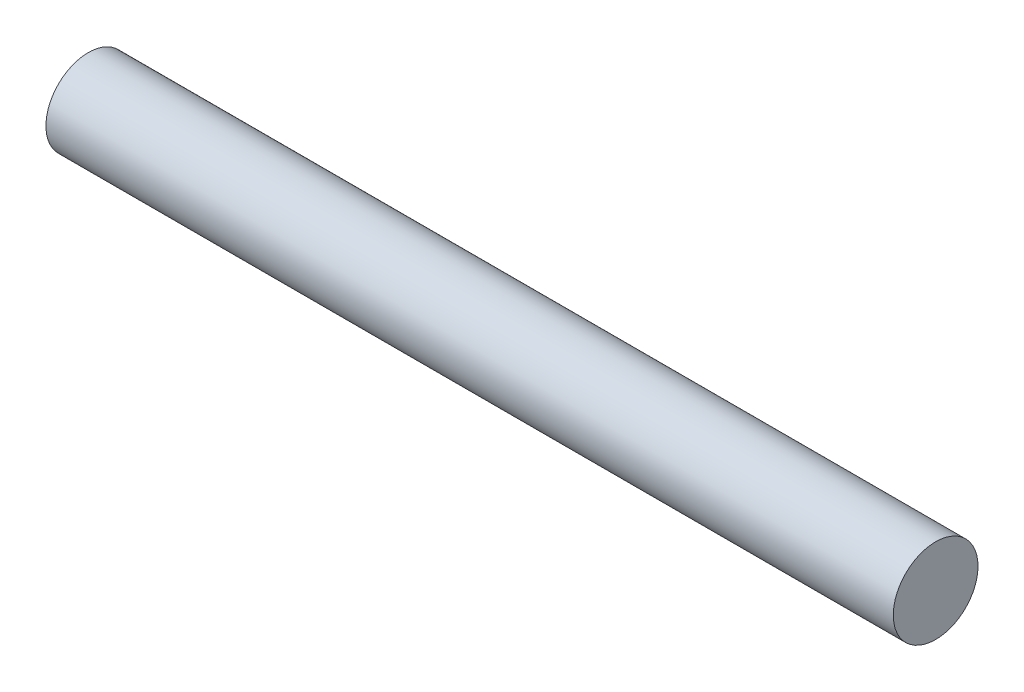
ISO-10303-21;
HEADER;
FILE_DESCRIPTION(('STEP AP214'),'2;1');
FILE_NAME('part.step','',(''),(''),'','','');
FILE_SCHEMA(('AUTOMOTIVE_DESIGN { 1 0 10303 214 1 1 1 1 }'));
ENDSEC;
DATA;
#1=APPLICATION_CONTEXT('core data for automotive mechanical design processes');
#2=APPLICATION_PROTOCOL_DEFINITION('international standard','automotive_design',2000,#1);
#3=PRODUCT_CONTEXT('',#1,'mechanical');
#4=PRODUCT('Part','Part','',(#3));
#5=PRODUCT_RELATED_PRODUCT_CATEGORY('part','',(#4));
#6=PRODUCT_DEFINITION_FORMATION('','',#4);
#7=PRODUCT_DEFINITION_CONTEXT('part definition',#1,'design');
#8=PRODUCT_DEFINITION('design','',#6,#7);
#9=PRODUCT_DEFINITION_SHAPE('','',#8);
#10=(LENGTH_UNIT() NAMED_UNIT(*) SI_UNIT(.MILLI.,.METRE.));
#11=(NAMED_UNIT(*) PLANE_ANGLE_UNIT() SI_UNIT($,.RADIAN.));
#12=(NAMED_UNIT(*) SI_UNIT($,.STERADIAN.) SOLID_ANGLE_UNIT());
#13=UNCERTAINTY_MEASURE_WITH_UNIT(LENGTH_MEASURE(1.E-05),#10,'distance_accuracy_value','');
#14=(GEOMETRIC_REPRESENTATION_CONTEXT(3) GLOBAL_UNCERTAINTY_ASSIGNED_CONTEXT((#13)) GLOBAL_UNIT_ASSIGNED_CONTEXT((#10,
#11,#12)) REPRESENTATION_CONTEXT('',''));
#15=CARTESIAN_POINT('',(0.,0.,0.));
#16=DIRECTION('',(0.,0.,1.));
#17=DIRECTION('',(1.,0.,0.));
#18=AXIS2_PLACEMENT_3D('',#15,#16,#17);
#19=CARTESIAN_POINT('',(190.5,0.,0.));
#20=DIRECTION('',(-1.,0.,0.));
#21=DIRECTION('',(0.,0.,1.));
#22=AXIS2_PLACEMENT_3D('',#19,#20,#21);
#23=CYLINDRICAL_SURFACE('',#22,9.525);
#24=CARTESIAN_POINT('',(190.5,0.,0.));
#25=DIRECTION('',(1.,0.,0.));
#26=DIRECTION('',(0.,0.,-1.));
#27=AXIS2_PLACEMENT_3D('',#24,#25,#26);
#28=CIRCLE('',#27,9.525);
#29=CARTESIAN_POINT('',(190.5,0.,-9.525));
#30=VERTEX_POINT('',#29);
#31=EDGE_CURVE('E10',#30,#30,#28,.T.);
#32=ORIENTED_EDGE('',*,*,#31,.F.);
#33=EDGE_LOOP('',(#32));
#34=FACE_BOUND('',#33,.T.);
#35=CARTESIAN_POINT('',(0.,0.,0.));
#36=DIRECTION('',(1.,0.,0.));
#37=DIRECTION('',(0.,0.,-1.));
#38=AXIS2_PLACEMENT_3D('',#35,#36,#37);
#39=CIRCLE('',#38,9.525);
#40=CARTESIAN_POINT('',(0.,0.,-9.525));
#41=VERTEX_POINT('',#40);
#42=EDGE_CURVE('E33',#41,#41,#39,.T.);
#43=ORIENTED_EDGE('',*,*,#42,.T.);
#44=EDGE_LOOP('',(#43));
#45=FACE_BOUND('',#44,.T.);
#46=ADVANCED_FACE('F30',(#34,#45),#23,.T.);
#47=CARTESIAN_POINT('',(190.5,0.,0.));
#48=DIRECTION('',(1.,0.,0.));
#49=DIRECTION('',(0.,0.,-1.));
#50=AXIS2_PLACEMENT_3D('',#47,#48,#49);
#51=PLANE('',#50);
#52=ORIENTED_EDGE('',*,*,#31,.T.);
#53=EDGE_LOOP('',(#52));
#54=FACE_BOUND('',#53,.T.);
#55=ADVANCED_FACE('F45',(#54),#51,.T.);
#56=CARTESIAN_POINT('',(0.,0.,0.));
#57=DIRECTION('',(1.,0.,0.));
#58=DIRECTION('',(0.,0.,-1.));
#59=AXIS2_PLACEMENT_3D('',#56,#57,#58);
#60=PLANE('',#59);
#61=ORIENTED_EDGE('',*,*,#42,.F.);
#62=EDGE_LOOP('',(#61));
#63=FACE_BOUND('',#62,.T.);
#64=ADVANCED_FACE('F43',(#63),#60,.F.);
#65=CLOSED_SHELL('',(#46,#55,#64));
#66=MANIFOLD_SOLID_BREP('B2',#65);
#67=ADVANCED_BREP_SHAPE_REPRESENTATION('',(#18,#66),#14);
#68=SHAPE_DEFINITION_REPRESENTATION(#9,#67);
ENDSEC;
END-ISO-10303-21;
